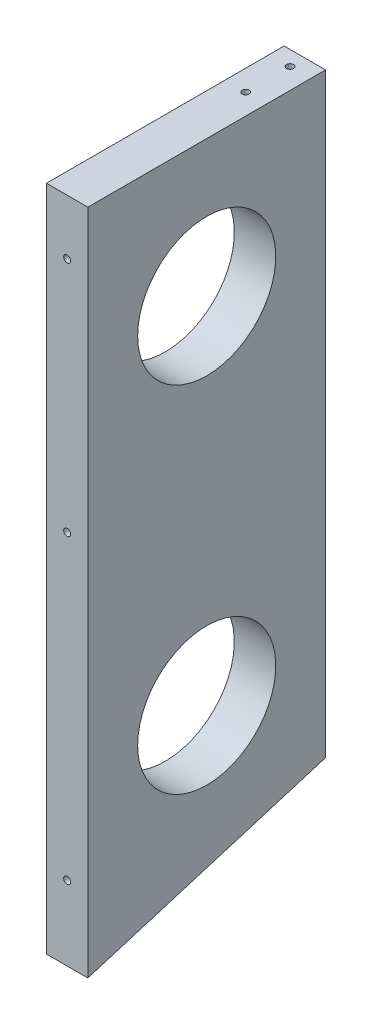
ISO-10303-21;
HEADER;
FILE_DESCRIPTION(('STEP AP214'),'2;1');
FILE_NAME('part.step','',(''),(''),'','','');
FILE_SCHEMA(('AUTOMOTIVE_DESIGN { 1 0 10303 214 1 1 1 1 }'));
ENDSEC;
DATA;
#1=APPLICATION_CONTEXT('core data for automotive mechanical design processes');
#2=APPLICATION_PROTOCOL_DEFINITION('international standard','automotive_design',2000,#1);
#3=PRODUCT_CONTEXT('',#1,'mechanical');
#4=PRODUCT('Part','Part','',(#3));
#5=PRODUCT_RELATED_PRODUCT_CATEGORY('part','',(#4));
#6=PRODUCT_DEFINITION_FORMATION('','',#4);
#7=PRODUCT_DEFINITION_CONTEXT('part definition',#1,'design');
#8=PRODUCT_DEFINITION('design','',#6,#7);
#9=PRODUCT_DEFINITION_SHAPE('','',#8);
#10=(LENGTH_UNIT() NAMED_UNIT(*) SI_UNIT(.MILLI.,.METRE.));
#11=(NAMED_UNIT(*) PLANE_ANGLE_UNIT() SI_UNIT($,.RADIAN.));
#12=(NAMED_UNIT(*) SI_UNIT($,.STERADIAN.) SOLID_ANGLE_UNIT());
#13=UNCERTAINTY_MEASURE_WITH_UNIT(LENGTH_MEASURE(1.E-05),#10,'distance_accuracy_value','');
#14=(GEOMETRIC_REPRESENTATION_CONTEXT(3) GLOBAL_UNCERTAINTY_ASSIGNED_CONTEXT((#13)) GLOBAL_UNIT_ASSIGNED_CONTEXT((#10,
#11,#12)) REPRESENTATION_CONTEXT('',''));
#15=CARTESIAN_POINT('',(0.,0.,0.));
#16=DIRECTION('',(0.,0.,1.));
#17=DIRECTION('',(1.,0.,0.));
#18=AXIS2_PLACEMENT_3D('',#15,#16,#17);
#19=CARTESIAN_POINT('',(-133.529465969192,-157.30000000001,304.663224626951));
#20=DIRECTION('',(1.,0.,0.));
#21=DIRECTION('',(0.,1.00000000000003,0.));
#22=AXIS2_PLACEMENT_3D('',#19,#20,#21);
#23=PLANE('',#22);
#24=CARTESIAN_POINT('',(-133.529465969192,-383.056061932783,54.6500000000077));
#25=DIRECTION('',(-0.999999999999999,0.,0.));
#26=DIRECTION('',(0.,0.,1.00000000000002));
#27=AXIS2_PLACEMENT_3D('',#24,#25,#26);
#28=CIRCLE('',#27,31.75);
#29=CARTESIAN_POINT('',(-133.529465969192,-383.056061932783,86.4000000000084));
#30=VERTEX_POINT('',#29);
#31=EDGE_CURVE('E120',#30,#30,#28,.T.);
#32=ORIENTED_EDGE('',*,*,#31,.F.);
#33=EDGE_LOOP('',(#32));
#34=FACE_BOUND('',#33,.T.);
#35=DIRECTION('',(0.,-1.00000000000003,0.));
#36=VECTOR('',#35,1.);
#37=CARTESIAN_POINT('',(-133.529465969193,-157.300000000006,2.60902410786912E-12));
#38=LINE('',#37,#36);
#39=CARTESIAN_POINT('',(-133.529465969193,-157.300000000006,2.60902410786912E-12));
#40=VERTEX_POINT('',#39);
#41=CARTESIAN_POINT('',(-133.529465969192,-431.185843453159,7.18869408444789E-12));
#42=VERTEX_POINT('',#41);
#43=EDGE_CURVE('E43',#40,#42,#38,.T.);
#44=ORIENTED_EDGE('',*,*,#43,.T.);
#45=DIRECTION('',(0.,-0.289678602973869,0.957123976807169));
#46=VECTOR('',#45,1.);
#47=CARTESIAN_POINT('',(-133.529465969192,-464.266063019556,109.300000000011));
#48=LINE('',#47,#46);
#49=CARTESIAN_POINT('',(-133.529465969192,-464.266063019556,109.300000000011));
#50=VERTEX_POINT('',#49);
#51=EDGE_CURVE('E163',#42,#50,#48,.T.);
#52=ORIENTED_EDGE('',*,*,#51,.T.);
#53=DIRECTION('',(0.,-1.00000000000003,0.));
#54=VECTOR('',#53,1.);
#55=CARTESIAN_POINT('',(-133.529465969192,-157.300000000008,109.300000000005));
#56=LINE('',#55,#54);
#57=CARTESIAN_POINT('',(-133.529465969192,-157.300000000008,109.300000000006));
#58=VERTEX_POINT('',#57);
#59=EDGE_CURVE('E169',#58,#50,#56,.T.);
#60=ORIENTED_EDGE('',*,*,#59,.F.);
#61=DIRECTION('',(0.,0.,-1.00000000000002));
#62=VECTOR('',#61,1.);
#63=CARTESIAN_POINT('',(-133.529465969192,-157.30000000001,304.663224626951));
#64=LINE('',#63,#62);
#65=EDGE_CURVE('E51',#58,#40,#64,.T.);
#66=ORIENTED_EDGE('',*,*,#65,.T.);
#67=EDGE_LOOP('',(#44,#52,#60,#66));
#68=FACE_BOUND('',#67,.T.);
#69=CARTESIAN_POINT('',(-133.529465969192,-220.048030423009,54.6500000000054));
#70=DIRECTION('',(-0.999999999999999,0.,0.));
#71=DIRECTION('',(0.,0.,1.00000000000002));
#72=AXIS2_PLACEMENT_3D('',#69,#70,#71);
#73=CIRCLE('',#72,31.75);
#74=CARTESIAN_POINT('',(-133.529465969192,-220.048030423009,86.4000000000061));
#75=VERTEX_POINT('',#74);
#76=EDGE_CURVE('E411',#75,#75,#73,.T.);
#77=ORIENTED_EDGE('',*,*,#76,.F.);
#78=EDGE_LOOP('',(#77));
#79=FACE_BOUND('',#78,.T.);
#80=ADVANCED_FACE('F34',(#34,#68,#79),#23,.F.);
#81=CARTESIAN_POINT('',(-133.529465969192,-157.30000000001,304.663224626951));
#82=DIRECTION('',(0.,-1.00000000000003,0.));
#83=DIRECTION('',(0.,0.,-1.00000000000002));
#84=AXIS2_PLACEMENT_3D('',#81,#82,#83);
#85=PLANE('',#84);
#86=CARTESIAN_POINT('',(-124.004465969192,-157.300000000007,27.2000000000031));
#87=DIRECTION('',(0.,-1.00000000000003,0.));
#88=DIRECTION('',(0.,0.,-1.00000000000002));
#89=AXIS2_PLACEMENT_3D('',#86,#87,#88);
#90=CIRCLE('',#89,1.5875);
#91=CARTESIAN_POINT('',(-124.004465969192,-157.300000000006,25.612500000003));
#92=VERTEX_POINT('',#91);
#93=EDGE_CURVE('E142',#92,#92,#90,.T.);
#94=ORIENTED_EDGE('',*,*,#93,.T.);
#95=EDGE_LOOP('',(#94));
#96=FACE_BOUND('',#95,.T.);
#97=CARTESIAN_POINT('',(-124.004465969192,-157.300000000006,6.80000000000236));
#98=DIRECTION('',(0.,-1.00000000000003,0.));
#99=DIRECTION('',(0.,0.,-1.00000000000002));
#100=AXIS2_PLACEMENT_3D('',#97,#98,#99);
#101=CIRCLE('',#100,1.5875);
#102=CARTESIAN_POINT('',(-124.004465969192,-157.300000000006,5.21250000000232));
#103=VERTEX_POINT('',#102);
#104=EDGE_CURVE('E146',#103,#103,#101,.T.);
#105=ORIENTED_EDGE('',*,*,#104,.T.);
#106=EDGE_LOOP('',(#105));
#107=FACE_BOUND('',#106,.T.);
#108=ORIENTED_EDGE('',*,*,#65,.F.);
#109=DIRECTION('',(-1.,0.,0.));
#110=VECTOR('',#109,1.);
#111=CARTESIAN_POINT('',(-114.479465969193,-157.300000000008,109.300000000006));
#112=LINE('',#111,#110);
#113=CARTESIAN_POINT('',(-114.479465969192,-157.300000000008,109.300000000005));
#114=VERTEX_POINT('',#113);
#115=EDGE_CURVE('E172',#114,#58,#112,.T.);
#116=ORIENTED_EDGE('',*,*,#115,.F.);
#117=DIRECTION('',(0.,0.,-1.00000000000002));
#118=VECTOR('',#117,1.);
#119=CARTESIAN_POINT('',(-114.479465969192,-157.300000000011,304.663224626951));
#120=LINE('',#119,#118);
#121=CARTESIAN_POINT('',(-114.479465969192,-157.300000000005,2.41473507855972E-12));
#122=VERTEX_POINT('',#121);
#123=EDGE_CURVE('E59',#114,#122,#120,.T.);
#124=ORIENTED_EDGE('',*,*,#123,.T.);
#125=DIRECTION('',(-0.999999999999999,0.,0.));
#126=VECTOR('',#125,1.);
#127=CARTESIAN_POINT('',(-133.529465969193,-157.300000000006,2.60902410786912E-12));
#128=LINE('',#127,#126);
#129=EDGE_CURVE('E180',#122,#40,#128,.T.);
#130=ORIENTED_EDGE('',*,*,#129,.T.);
#131=EDGE_LOOP('',(#108,#116,#124,#130));
#132=FACE_BOUND('',#131,.T.);
#133=ADVANCED_FACE('F36',(#96,#107,#132),#85,.F.);
#134=CARTESIAN_POINT('',(-114.479465969192,-157.300000000011,304.663224626951));
#135=DIRECTION('',(-1.,0.,0.));
#136=DIRECTION('',(0.,-1.00000000000003,0.));
#137=AXIS2_PLACEMENT_3D('',#134,#135,#136);
#138=PLANE('',#137);
#139=CARTESIAN_POINT('',(-114.479465969192,-220.048030423009,54.6500000000053));
#140=DIRECTION('',(-1.,0.,0.));
#141=DIRECTION('',(0.,-1.00000000000003,0.));
#142=AXIS2_PLACEMENT_3D('',#139,#140,#141);
#143=CIRCLE('',#142,31.75);
#144=CARTESIAN_POINT('',(-114.479465969192,-251.79803042301,54.6500000000058));
#145=VERTEX_POINT('',#144);
#146=EDGE_CURVE('E408',#145,#145,#143,.T.);
#147=ORIENTED_EDGE('',*,*,#146,.T.);
#148=EDGE_LOOP('',(#147));
#149=FACE_BOUND('',#148,.T.);
#150=CARTESIAN_POINT('',(-114.479465969192,-383.056061932783,54.6500000000078));
#151=DIRECTION('',(-1.,0.,0.));
#152=DIRECTION('',(0.,-1.00000000000003,0.));
#153=AXIS2_PLACEMENT_3D('',#150,#151,#152);
#154=CIRCLE('',#153,31.75);
#155=CARTESIAN_POINT('',(-114.479465969192,-414.806061932784,54.6500000000083));
#156=VERTEX_POINT('',#155);
#157=EDGE_CURVE('E115',#156,#156,#154,.T.);
#158=ORIENTED_EDGE('',*,*,#157,.T.);
#159=EDGE_LOOP('',(#158));
#160=FACE_BOUND('',#159,.T.);
#161=ORIENTED_EDGE('',*,*,#123,.F.);
#162=DIRECTION('',(0.,1.00000000000003,0.));
#163=VECTOR('',#162,1.);
#164=CARTESIAN_POINT('',(-114.479465969192,-427.342121692014,109.30000000001));
#165=LINE('',#164,#163);
#166=CARTESIAN_POINT('',(-114.479465969192,-464.266063019556,109.30000000001));
#167=VERTEX_POINT('',#166);
#168=EDGE_CURVE('E175',#167,#114,#165,.T.);
#169=ORIENTED_EDGE('',*,*,#168,.F.);
#170=DIRECTION('',(0.,-0.289678602973869,0.957123976807169));
#171=VECTOR('',#170,1.);
#172=CARTESIAN_POINT('',(-114.479465969192,-464.266063019556,109.30000000001));
#173=LINE('',#172,#171);
#174=CARTESIAN_POINT('',(-114.479465969192,-431.185843453159,7.105427357601E-12));
#175=VERTEX_POINT('',#174);
#176=EDGE_CURVE('E159',#175,#167,#173,.T.);
#177=ORIENTED_EDGE('',*,*,#176,.F.);
#178=DIRECTION('',(0.,1.00000000000003,0.));
#179=VECTOR('',#178,1.);
#180=CARTESIAN_POINT('',(-114.479465969192,-157.300000000005,2.41473507855972E-12));
#181=LINE('',#180,#179);
#182=EDGE_CURVE('E11',#175,#122,#181,.T.);
#183=ORIENTED_EDGE('',*,*,#182,.T.);
#184=EDGE_LOOP('',(#161,#169,#177,#183));
#185=FACE_BOUND('',#184,.T.);
#186=ADVANCED_FACE('F220',(#149,#160,#185),#138,.F.);
#187=CARTESIAN_POINT('',(0.,0.,0.));
#188=DIRECTION('',(0.,0.,-1.00000000000002));
#189=DIRECTION('',(-0.999999999999999,0.,0.));
#190=AXIS2_PLACEMENT_3D('',#187,#188,#189);
#191=PLANE('',#190);
#192=CARTESIAN_POINT('',(-124.004465969192,-182.700000000007,3.3584246494911E-12));
#193=DIRECTION('',(0.,0.,-1.00000000000002));
#194=DIRECTION('',(-0.999999999999999,0.,0.));
#195=AXIS2_PLACEMENT_3D('',#192,#193,#194);
#196=CIRCLE('',#195,1.58750000000001);
#197=CARTESIAN_POINT('',(-125.591965969192,-182.700000000007,3.35930588901689E-12));
#198=VERTEX_POINT('',#197);
#199=EDGE_CURVE('E130',#198,#198,#196,.T.);
#200=ORIENTED_EDGE('',*,*,#199,.F.);
#201=EDGE_LOOP('',(#200));
#202=FACE_BOUND('',#201,.T.);
#203=CARTESIAN_POINT('',(-124.004465969192,-291.546060846016,5.10702591327572E-12));
#204=DIRECTION('',(0.,0.,-1.00000000000002));
#205=DIRECTION('',(-0.999999999999999,0.,0.));
#206=AXIS2_PLACEMENT_3D('',#203,#204,#205);
#207=CIRCLE('',#206,1.58750000000001);
#208=CARTESIAN_POINT('',(-125.591965969192,-291.546060846016,5.10790715280152E-12));
#209=VERTEX_POINT('',#208);
#210=EDGE_CURVE('E134',#209,#209,#207,.T.);
#211=ORIENTED_EDGE('',*,*,#210,.F.);
#212=EDGE_LOOP('',(#211));
#213=FACE_BOUND('',#212,.T.);
#214=CARTESIAN_POINT('',(-124.004465969192,-401.942121691994,6.43929354282591E-12));
#215=DIRECTION('',(0.,0.,-1.00000000000002));
#216=DIRECTION('',(-0.999999999999999,0.,0.));
#217=AXIS2_PLACEMENT_3D('',#214,#215,#216);
#218=CIRCLE('',#217,1.5875);
#219=CARTESIAN_POINT('',(-125.591965969192,-401.942121691994,6.4401747823517E-12));
#220=VERTEX_POINT('',#219);
#221=EDGE_CURVE('E138',#220,#220,#218,.T.);
#222=ORIENTED_EDGE('',*,*,#221,.F.);
#223=EDGE_LOOP('',(#222));
#224=FACE_BOUND('',#223,.T.);
#225=ORIENTED_EDGE('',*,*,#129,.F.);
#226=ORIENTED_EDGE('',*,*,#182,.F.);
#227=DIRECTION('',(-1.,0.,0.));
#228=VECTOR('',#227,1.);
#229=CARTESIAN_POINT('',(-114.479465969192,-431.185843453159,7.105427357601E-12));
#230=LINE('',#229,#228);
#231=EDGE_CURVE('E162',#175,#42,#230,.T.);
#232=ORIENTED_EDGE('',*,*,#231,.T.);
#233=ORIENTED_EDGE('',*,*,#43,.F.);
#234=EDGE_LOOP('',(#225,#226,#232,#233));
#235=FACE_BOUND('',#234,.T.);
#236=ADVANCED_FACE('F218',(#202,#213,#224,#235),#191,.T.);
#237=CARTESIAN_POINT('',(4.57966997657877E-13,-204.862851166385,109.300000000006));
#238=DIRECTION('',(0.,0.,1.00000000000002));
#239=DIRECTION('',(-1.,0.,0.));
#240=AXIS2_PLACEMENT_3D('',#237,#238,#239);
#241=PLANE('',#240);
#242=CARTESIAN_POINT('',(-124.004465969192,-182.700000000009,109.300000000006));
#243=DIRECTION('',(0.,0.,1.00000000000002));
#244=DIRECTION('',(1.,0.,0.));
#245=AXIS2_PLACEMENT_3D('',#242,#243,#244);
#246=CIRCLE('',#245,1.58750000000001);
#247=CARTESIAN_POINT('',(-122.416965969192,-182.700000000009,109.300000000006));
#248=VERTEX_POINT('',#247);
#249=EDGE_CURVE('E150',#248,#248,#246,.T.);
#250=ORIENTED_EDGE('',*,*,#249,.F.);
#251=EDGE_LOOP('',(#250));
#252=FACE_BOUND('',#251,.T.);
#253=CARTESIAN_POINT('',(-124.004465969192,-430.129493562015,109.30000000001));
#254=DIRECTION('',(0.,0.,1.00000000000002));
#255=DIRECTION('',(1.,0.,0.));
#256=AXIS2_PLACEMENT_3D('',#253,#254,#255);
#257=CIRCLE('',#256,1.58750000000001);
#258=CARTESIAN_POINT('',(-122.416965969192,-430.129493562015,109.30000000001));
#259=VERTEX_POINT('',#258);
#260=EDGE_CURVE('E154',#259,#259,#257,.T.);
#261=ORIENTED_EDGE('',*,*,#260,.F.);
#262=EDGE_LOOP('',(#261));
#263=FACE_BOUND('',#262,.T.);
#264=CARTESIAN_POINT('',(-124.004465969192,-291.546060846017,109.300000000008));
#265=DIRECTION('',(0.,0.,1.00000000000002));
#266=DIRECTION('',(1.,0.,0.));
#267=AXIS2_PLACEMENT_3D('',#264,#265,#266);
#268=CIRCLE('',#267,1.58750000000001);
#269=CARTESIAN_POINT('',(-122.416965969192,-291.546060846017,109.300000000008));
#270=VERTEX_POINT('',#269);
#271=EDGE_CURVE('E158',#270,#270,#268,.T.);
#272=ORIENTED_EDGE('',*,*,#271,.F.);
#273=EDGE_LOOP('',(#272));
#274=FACE_BOUND('',#273,.T.);
#275=ORIENTED_EDGE('',*,*,#59,.T.);
#276=DIRECTION('',(-1.,0.,0.));
#277=VECTOR('',#276,1.);
#278=CARTESIAN_POINT('',(-114.479465969192,-464.266063019556,109.30000000001));
#279=LINE('',#278,#277);
#280=EDGE_CURVE('E166',#167,#50,#279,.T.);
#281=ORIENTED_EDGE('',*,*,#280,.F.);
#282=ORIENTED_EDGE('',*,*,#168,.T.);
#283=ORIENTED_EDGE('',*,*,#115,.T.);
#284=EDGE_LOOP('',(#275,#281,#282,#283));
#285=FACE_BOUND('',#284,.T.);
#286=ADVANCED_FACE('F208',(#252,#263,#274,#285),#241,.T.);
#287=CARTESIAN_POINT('',(-114.479465969192,-464.266063019556,109.30000000001));
#288=DIRECTION('',(0.,-0.957123976807169,-0.289678602973836));
#289=DIRECTION('',(0.,0.289678602973869,-0.957123976807169));
#290=AXIS2_PLACEMENT_3D('',#287,#288,#289);
#291=PLANE('',#290);
#292=CARTESIAN_POINT('',(-124.004465969193,-439.455898344757,27.3250000000025));
#293=DIRECTION('',(0.,-0.957123976807169,-0.289678602973836));
#294=DIRECTION('',(0.,0.289678602973869,-0.957123976807169));
#295=AXIS2_PLACEMENT_3D('',#292,#293,#294);
#296=CIRCLE('',#295,1.5875);
#297=CARTESIAN_POINT('',(-124.004465969193,-438.996033562536,25.8055656868212));
#298=VERTEX_POINT('',#297);
#299=EDGE_CURVE('E38',#298,#298,#296,.T.);
#300=ORIENTED_EDGE('',*,*,#299,.F.);
#301=EDGE_LOOP('',(#300));
#302=FACE_BOUND('',#301,.T.);
#303=CARTESIAN_POINT('',(-124.004465969193,-455.996008127955,81.9750000000042));
#304=DIRECTION('',(0.,-0.957123976807169,-0.289678602973836));
#305=DIRECTION('',(0.,0.289678602973869,-0.957123976807169));
#306=AXIS2_PLACEMENT_3D('',#303,#304,#305);
#307=CIRCLE('',#306,1.5875);
#308=CARTESIAN_POINT('',(-124.004465969193,-455.536143345734,80.4555656868228));
#309=VERTEX_POINT('',#308);
#310=EDGE_CURVE('E126',#309,#309,#307,.T.);
#311=ORIENTED_EDGE('',*,*,#310,.F.);
#312=EDGE_LOOP('',(#311));
#313=FACE_BOUND('',#312,.T.);
#314=ORIENTED_EDGE('',*,*,#51,.F.);
#315=ORIENTED_EDGE('',*,*,#231,.F.);
#316=ORIENTED_EDGE('',*,*,#176,.T.);
#317=ORIENTED_EDGE('',*,*,#280,.T.);
#318=EDGE_LOOP('',(#314,#315,#316,#317));
#319=FACE_BOUND('',#318,.T.);
#320=ADVANCED_FACE('F204',(#302,#313,#319),#291,.T.);
#321=CARTESIAN_POINT('',(-124.004465969192,-291.546060846017,90.250000000007));
#322=DIRECTION('',(0.,0.,1.00000000000002));
#323=DIRECTION('',(0.999999999999999,0.,0.));
#324=AXIS2_PLACEMENT_3D('',#321,#322,#323);
#325=CONICAL_SURFACE('',#324,1.58750000000001,1.02974425867666);
#326=CARTESIAN_POINT('',(-124.004465969192,-291.546060846017,89.296133767301));
#327=VERTEX_POINT('',#326);
#328=VERTEX_LOOP('',#327);
#329=FACE_BOUND('',#328,.T.);
#330=CARTESIAN_POINT('',(-124.004465969192,-291.546060846017,90.250000000007));
#331=DIRECTION('',(0.,0.,1.00000000000002));
#332=DIRECTION('',(0.999999999999999,0.,0.));
#333=AXIS2_PLACEMENT_3D('',#330,#331,#332);
#334=CIRCLE('',#333,1.58750000000001);
#335=CARTESIAN_POINT('',(-122.416965969192,-291.546060846017,90.250000000007));
#336=VERTEX_POINT('',#335);
#337=EDGE_CURVE('E155',#336,#336,#334,.T.);
#338=ORIENTED_EDGE('',*,*,#337,.T.);
#339=EDGE_LOOP('',(#338));
#340=FACE_BOUND('',#339,.T.);
#341=ADVANCED_FACE('F207',(#329,#340),#325,.F.);
#342=CARTESIAN_POINT('',(-124.004465969192,-291.546060846018,122.000000000007));
#343=DIRECTION('',(0.,0.,1.00000000000002));
#344=DIRECTION('',(0.999999999999999,0.,0.));
#345=AXIS2_PLACEMENT_3D('',#342,#343,#344);
#346=CYLINDRICAL_SURFACE('',#345,1.58750000000001);
#347=ORIENTED_EDGE('',*,*,#271,.T.);
#348=EDGE_LOOP('',(#347));
#349=FACE_BOUND('',#348,.T.);
#350=ORIENTED_EDGE('',*,*,#337,.F.);
#351=EDGE_LOOP('',(#350));
#352=FACE_BOUND('',#351,.T.);
#353=ADVANCED_FACE('F266',(#349,#352),#346,.F.);
#354=CARTESIAN_POINT('',(-124.004465969192,-430.129493562014,90.2500000000092));
#355=DIRECTION('',(0.,0.,1.00000000000002));
#356=DIRECTION('',(0.999999999999999,0.,0.));
#357=AXIS2_PLACEMENT_3D('',#354,#355,#356);
#358=CONICAL_SURFACE('',#357,1.58750000000001,1.02974425867666);
#359=CARTESIAN_POINT('',(-124.004465969192,-430.129493562014,89.2961337673028));
#360=VERTEX_POINT('',#359);
#361=VERTEX_LOOP('',#360);
#362=FACE_BOUND('',#361,.T.);
#363=CARTESIAN_POINT('',(-124.004465969192,-430.129493562014,90.2500000000092));
#364=DIRECTION('',(0.,0.,1.00000000000002));
#365=DIRECTION('',(0.999999999999999,0.,0.));
#366=AXIS2_PLACEMENT_3D('',#363,#364,#365);
#367=CIRCLE('',#366,1.58750000000001);
#368=CARTESIAN_POINT('',(-122.416965969192,-430.129493562014,90.2500000000092));
#369=VERTEX_POINT('',#368);
#370=EDGE_CURVE('E151',#369,#369,#367,.T.);
#371=ORIENTED_EDGE('',*,*,#370,.T.);
#372=EDGE_LOOP('',(#371));
#373=FACE_BOUND('',#372,.T.);
#374=ADVANCED_FACE('F262',(#362,#373),#358,.F.);
#375=CARTESIAN_POINT('',(-124.004465969192,-430.129493562014,122.00000000001));
#376=DIRECTION('',(0.,0.,1.00000000000002));
#377=DIRECTION('',(0.999999999999999,0.,0.));
#378=AXIS2_PLACEMENT_3D('',#375,#376,#377);
#379=CYLINDRICAL_SURFACE('',#378,1.58750000000001);
#380=ORIENTED_EDGE('',*,*,#260,.T.);
#381=EDGE_LOOP('',(#380));
#382=FACE_BOUND('',#381,.T.);
#383=ORIENTED_EDGE('',*,*,#370,.F.);
#384=EDGE_LOOP('',(#383));
#385=FACE_BOUND('',#384,.T.);
#386=ADVANCED_FACE('F258',(#382,#385),#379,.F.);
#387=CARTESIAN_POINT('',(-124.004465969192,-182.700000000008,90.2500000000051));
#388=DIRECTION('',(0.,0.,1.00000000000002));
#389=DIRECTION('',(0.999999999999999,0.,0.));
#390=AXIS2_PLACEMENT_3D('',#387,#388,#389);
#391=CONICAL_SURFACE('',#390,1.58750000000001,1.02974425867666);
#392=CARTESIAN_POINT('',(-124.004465969192,-182.700000000008,89.2961337672989));
#393=VERTEX_POINT('',#392);
#394=VERTEX_LOOP('',#393);
#395=FACE_BOUND('',#394,.T.);
#396=CARTESIAN_POINT('',(-124.004465969192,-182.700000000008,90.2500000000051));
#397=DIRECTION('',(0.,0.,1.00000000000002));
#398=DIRECTION('',(0.999999999999999,0.,0.));
#399=AXIS2_PLACEMENT_3D('',#396,#397,#398);
#400=CIRCLE('',#399,1.58750000000001);
#401=CARTESIAN_POINT('',(-122.416965969192,-182.700000000008,90.2500000000051));
#402=VERTEX_POINT('',#401);
#403=EDGE_CURVE('E147',#402,#402,#400,.T.);
#404=ORIENTED_EDGE('',*,*,#403,.T.);
#405=EDGE_LOOP('',(#404));
#406=FACE_BOUND('',#405,.T.);
#407=ADVANCED_FACE('F248',(#395,#406),#391,.F.);
#408=CARTESIAN_POINT('',(-124.004465969192,-182.700000000009,122.000000000006));
#409=DIRECTION('',(0.,0.,1.00000000000002));
#410=DIRECTION('',(0.999999999999999,0.,0.));
#411=AXIS2_PLACEMENT_3D('',#408,#409,#410);
#412=CYLINDRICAL_SURFACE('',#411,1.58750000000001);
#413=ORIENTED_EDGE('',*,*,#249,.T.);
#414=EDGE_LOOP('',(#413));
#415=FACE_BOUND('',#414,.T.);
#416=ORIENTED_EDGE('',*,*,#403,.F.);
#417=EDGE_LOOP('',(#416));
#418=FACE_BOUND('',#417,.T.);
#419=ADVANCED_FACE('F238',(#415,#418),#412,.F.);
#420=CARTESIAN_POINT('',(-124.004465969192,-144.600000000006,6.80000000000267));
#421=DIRECTION('',(0.,1.00000000000003,0.));
#422=DIRECTION('',(0.,0.,1.00000000000002));
#423=AXIS2_PLACEMENT_3D('',#420,#421,#422);
#424=CYLINDRICAL_SURFACE('',#423,1.5875);
#425=CARTESIAN_POINT('',(-124.004465969192,-176.350000000006,6.80000000000347));
#426=DIRECTION('',(0.,1.00000000000003,0.));
#427=DIRECTION('',(0.,0.,1.00000000000002));
#428=AXIS2_PLACEMENT_3D('',#425,#426,#427);
#429=CIRCLE('',#428,1.58749999999999);
#430=CARTESIAN_POINT('',(-124.004465969192,-176.350000000006,8.3875000000035));
#431=VERTEX_POINT('',#430);
#432=EDGE_CURVE('E143',#431,#431,#429,.T.);
#433=ORIENTED_EDGE('',*,*,#432,.F.);
#434=EDGE_LOOP('',(#433));
#435=FACE_BOUND('',#434,.T.);
#436=ORIENTED_EDGE('',*,*,#104,.F.);
#437=EDGE_LOOP('',(#436));
#438=FACE_BOUND('',#437,.T.);
#439=ADVANCED_FACE('F235',(#435,#438),#424,.F.);
#440=CARTESIAN_POINT('',(-124.004465969192,-176.350000000006,6.80000000000347));
#441=DIRECTION('',(0.,1.00000000000003,0.));
#442=DIRECTION('',(0.,0.,1.00000000000002));
#443=AXIS2_PLACEMENT_3D('',#440,#441,#442);
#444=CONICAL_SURFACE('',#443,1.58749999999999,1.02974425867666);
#445=CARTESIAN_POINT('',(-124.004465969192,-177.303866232713,6.80000000000319));
#446=VERTEX_POINT('',#445);
#447=VERTEX_LOOP('',#446);
#448=FACE_BOUND('',#447,.T.);
#449=ORIENTED_EDGE('',*,*,#432,.T.);
#450=EDGE_LOOP('',(#449));
#451=FACE_BOUND('',#450,.T.);
#452=ADVANCED_FACE('F237',(#448,#451),#444,.F.);
#453=CARTESIAN_POINT('',(-124.004465969192,-144.600000000006,27.2000000000033));
#454=DIRECTION('',(0.,1.00000000000003,0.));
#455=DIRECTION('',(0.,0.,1.00000000000002));
#456=AXIS2_PLACEMENT_3D('',#453,#454,#455);
#457=CYLINDRICAL_SURFACE('',#456,1.5875);
#458=CARTESIAN_POINT('',(-124.004465969192,-176.350000000007,27.2000000000041));
#459=DIRECTION('',(0.,1.00000000000003,0.));
#460=DIRECTION('',(0.,0.,1.00000000000002));
#461=AXIS2_PLACEMENT_3D('',#458,#459,#460);
#462=CIRCLE('',#461,1.58749999999999);
#463=CARTESIAN_POINT('',(-124.004465969192,-176.350000000007,28.7875000000041));
#464=VERTEX_POINT('',#463);
#465=EDGE_CURVE('E139',#464,#464,#462,.T.);
#466=ORIENTED_EDGE('',*,*,#465,.F.);
#467=EDGE_LOOP('',(#466));
#468=FACE_BOUND('',#467,.T.);
#469=ORIENTED_EDGE('',*,*,#93,.F.);
#470=EDGE_LOOP('',(#469));
#471=FACE_BOUND('',#470,.T.);
#472=ADVANCED_FACE('F245',(#468,#471),#457,.F.);
#473=CARTESIAN_POINT('',(-124.004465969192,-176.350000000007,27.2000000000041));
#474=DIRECTION('',(0.,1.00000000000003,0.));
#475=DIRECTION('',(0.,0.,1.00000000000002));
#476=AXIS2_PLACEMENT_3D('',#473,#474,#475);
#477=CONICAL_SURFACE('',#476,1.58749999999999,1.02974425867666);
#478=CARTESIAN_POINT('',(-124.004465969192,-177.303866232713,27.2000000000039));
#479=VERTEX_POINT('',#478);
#480=VERTEX_LOOP('',#479);
#481=FACE_BOUND('',#480,.T.);
#482=ORIENTED_EDGE('',*,*,#465,.T.);
#483=EDGE_LOOP('',(#482));
#484=FACE_BOUND('',#483,.T.);
#485=ADVANCED_FACE('F253',(#481,#484),#477,.F.);
#486=CARTESIAN_POINT('',(-124.004465969192,-401.942121691995,19.0500000000071));
#487=DIRECTION('',(0.,0.,-1.00000000000002));
#488=DIRECTION('',(0.,1.00000000000003,0.));
#489=AXIS2_PLACEMENT_3D('',#486,#487,#488);
#490=CONICAL_SURFACE('',#489,1.58749999999999,1.02974425867665);
#491=CARTESIAN_POINT('',(-124.004465969192,-401.942121691995,20.0038662327134));
#492=VERTEX_POINT('',#491);
#493=VERTEX_LOOP('',#492);
#494=FACE_BOUND('',#493,.T.);
#495=CARTESIAN_POINT('',(-124.004465969192,-401.942121691995,19.0500000000071));
#496=DIRECTION('',(0.,0.,-1.00000000000002));
#497=DIRECTION('',(0.,1.00000000000003,0.));
#498=AXIS2_PLACEMENT_3D('',#495,#496,#497);
#499=CIRCLE('',#498,1.58749999999999);
#500=CARTESIAN_POINT('',(-124.004465969192,-400.354621691995,19.0500000000071));
#501=VERTEX_POINT('',#500);
#502=EDGE_CURVE('E135',#501,#501,#499,.T.);
#503=ORIENTED_EDGE('',*,*,#502,.T.);
#504=EDGE_LOOP('',(#503));
#505=FACE_BOUND('',#504,.T.);
#506=ADVANCED_FACE('F291',(#494,#505),#490,.F.);
#507=CARTESIAN_POINT('',(-124.004465969192,-401.942121691994,-12.6999999999935));
#508=DIRECTION('',(0.,0.,-1.00000000000002));
#509=DIRECTION('',(0.,1.00000000000003,0.));
#510=AXIS2_PLACEMENT_3D('',#507,#508,#509);
#511=CYLINDRICAL_SURFACE('',#510,1.5875);
#512=ORIENTED_EDGE('',*,*,#221,.T.);
#513=EDGE_LOOP('',(#512));
#514=FACE_BOUND('',#513,.T.);
#515=ORIENTED_EDGE('',*,*,#502,.F.);
#516=EDGE_LOOP('',(#515));
#517=FACE_BOUND('',#516,.T.);
#518=ADVANCED_FACE('F287',(#514,#517),#511,.F.);
#519=CARTESIAN_POINT('',(-124.004465969192,-291.546060846016,19.0500000000054));
#520=DIRECTION('',(0.,0.,-1.00000000000002));
#521=DIRECTION('',(0.,1.00000000000003,0.));
#522=AXIS2_PLACEMENT_3D('',#519,#520,#521);
#523=CONICAL_SURFACE('',#522,1.58750000000001,1.02974425867666);
#524=CARTESIAN_POINT('',(-124.004465969192,-291.546060846016,20.0038662327116));
#525=VERTEX_POINT('',#524);
#526=VERTEX_LOOP('',#525);
#527=FACE_BOUND('',#526,.T.);
#528=CARTESIAN_POINT('',(-124.004465969192,-291.546060846016,19.0500000000054));
#529=DIRECTION('',(0.,0.,-1.00000000000002));
#530=DIRECTION('',(0.,1.00000000000003,0.));
#531=AXIS2_PLACEMENT_3D('',#528,#529,#530);
#532=CIRCLE('',#531,1.58750000000001);
#533=CARTESIAN_POINT('',(-124.004465969192,-289.958560846015,19.0500000000053));
#534=VERTEX_POINT('',#533);
#535=EDGE_CURVE('E131',#534,#534,#532,.T.);
#536=ORIENTED_EDGE('',*,*,#535,.T.);
#537=EDGE_LOOP('',(#536));
#538=FACE_BOUND('',#537,.T.);
#539=ADVANCED_FACE('F290',(#527,#538),#523,.F.);
#540=CARTESIAN_POINT('',(-124.004465969192,-291.546060846015,-12.6999999999955));
#541=DIRECTION('',(0.,0.,-1.00000000000002));
#542=DIRECTION('',(0.,1.00000000000003,0.));
#543=AXIS2_PLACEMENT_3D('',#540,#541,#542);
#544=CYLINDRICAL_SURFACE('',#543,1.58750000000001);
#545=ORIENTED_EDGE('',*,*,#210,.T.);
#546=EDGE_LOOP('',(#545));
#547=FACE_BOUND('',#546,.T.);
#548=ORIENTED_EDGE('',*,*,#535,.F.);
#549=EDGE_LOOP('',(#548));
#550=FACE_BOUND('',#549,.T.);
#551=ADVANCED_FACE('F329',(#547,#550),#544,.F.);
#552=CARTESIAN_POINT('',(-124.004465969192,-182.700000000007,19.0500000000036));
#553=DIRECTION('',(0.,0.,-1.00000000000002));
#554=DIRECTION('',(0.,1.00000000000003,0.));
#555=AXIS2_PLACEMENT_3D('',#552,#553,#554);
#556=CONICAL_SURFACE('',#555,1.58750000000001,1.02974425867666);
#557=CARTESIAN_POINT('',(-124.004465969192,-182.700000000007,20.0038662327099));
#558=VERTEX_POINT('',#557);
#559=VERTEX_LOOP('',#558);
#560=FACE_BOUND('',#559,.T.);
#561=CARTESIAN_POINT('',(-124.004465969192,-182.700000000007,19.0500000000036));
#562=DIRECTION('',(0.,0.,-1.00000000000002));
#563=DIRECTION('',(0.,1.00000000000003,0.));
#564=AXIS2_PLACEMENT_3D('',#561,#562,#563);
#565=CIRCLE('',#564,1.58750000000001);
#566=CARTESIAN_POINT('',(-124.004465969192,-181.112500000007,19.0500000000036));
#567=VERTEX_POINT('',#566);
#568=EDGE_CURVE('E127',#567,#567,#565,.T.);
#569=ORIENTED_EDGE('',*,*,#568,.T.);
#570=EDGE_LOOP('',(#569));
#571=FACE_BOUND('',#570,.T.);
#572=ADVANCED_FACE('F336',(#560,#571),#556,.F.);
#573=CARTESIAN_POINT('',(-124.004465969192,-182.700000000007,-12.6999999999973));
#574=DIRECTION('',(0.,0.,-1.00000000000002));
#575=DIRECTION('',(0.,1.00000000000003,0.));
#576=AXIS2_PLACEMENT_3D('',#573,#574,#575);
#577=CYLINDRICAL_SURFACE('',#576,1.58750000000001);
#578=ORIENTED_EDGE('',*,*,#199,.T.);
#579=EDGE_LOOP('',(#578));
#580=FACE_BOUND('',#579,.T.);
#581=ORIENTED_EDGE('',*,*,#568,.F.);
#582=EDGE_LOOP('',(#581));
#583=FACE_BOUND('',#582,.T.);
#584=ADVANCED_FACE('F344',(#580,#583),#577,.F.);
#585=CARTESIAN_POINT('',(-124.004465969193,-437.76279636978,87.4933773866556));
#586=DIRECTION('',(0.,-0.957123976807168,-0.289678602973836));
#587=DIRECTION('',(0.,0.28967860297387,-0.957123976807169));
#588=AXIS2_PLACEMENT_3D('',#585,#586,#587);
#589=CONICAL_SURFACE('',#588,1.58749999999999,1.02974425867664);
#590=CARTESIAN_POINT('',(-124.004465969193,-436.84982812779,87.76969202437));
#591=VERTEX_POINT('',#590);
#592=VERTEX_LOOP('',#591);
#593=FACE_BOUND('',#592,.T.);
#594=CARTESIAN_POINT('',(-124.004465969193,-437.76279636978,87.4933773866556));
#595=DIRECTION('',(0.,-0.957123976807168,-0.289678602973836));
#596=DIRECTION('',(0.,0.28967860297387,-0.957123976807169));
#597=AXIS2_PLACEMENT_3D('',#594,#595,#596);
#598=CIRCLE('',#597,1.58749999999999);
#599=CARTESIAN_POINT('',(-124.004465969193,-437.302931587559,85.9739430734742));
#600=VERTEX_POINT('',#599);
#601=EDGE_CURVE('E118',#600,#600,#598,.T.);
#602=ORIENTED_EDGE('',*,*,#601,.T.);
#603=EDGE_LOOP('',(#602));
#604=FACE_BOUND('',#603,.T.);
#605=ADVANCED_FACE('F352',(#593,#604),#589,.F.);
#606=CARTESIAN_POINT('',(-124.004465969193,-468.151482633408,78.2960817422363));
#607=DIRECTION('',(0.,-0.957123976807168,-0.289678602973836));
#608=DIRECTION('',(0.,0.28967860297387,-0.957123976807169));
#609=AXIS2_PLACEMENT_3D('',#606,#607,#608);
#610=CYLINDRICAL_SURFACE('',#609,1.5875);
#611=ORIENTED_EDGE('',*,*,#310,.T.);
#612=EDGE_LOOP('',(#611));
#613=FACE_BOUND('',#612,.T.);
#614=ORIENTED_EDGE('',*,*,#601,.F.);
#615=EDGE_LOOP('',(#614));
#616=FACE_BOUND('',#615,.T.);
#617=ADVANCED_FACE('F109',(#613,#616),#610,.F.);
#618=CARTESIAN_POINT('',(-124.004465969193,-421.222686586581,32.8433773866537));
#619=DIRECTION('',(0.,-0.957123976807168,-0.289678602973836));
#620=DIRECTION('',(0.,0.28967860297387,-0.957123976807169));
#621=AXIS2_PLACEMENT_3D('',#618,#619,#620);
#622=CONICAL_SURFACE('',#621,1.58749999999999,1.02974425867664);
#623=CARTESIAN_POINT('',(-124.004465969193,-420.309718344591,33.1196920243684));
#624=VERTEX_POINT('',#623);
#625=VERTEX_LOOP('',#624);
#626=FACE_BOUND('',#625,.T.);
#627=CARTESIAN_POINT('',(-124.004465969193,-421.222686586581,32.8433773866537));
#628=DIRECTION('',(0.,-0.957123976807168,-0.289678602973836));
#629=DIRECTION('',(0.,0.28967860297387,-0.957123976807169));
#630=AXIS2_PLACEMENT_3D('',#627,#628,#629);
#631=CIRCLE('',#630,1.58749999999999);
#632=CARTESIAN_POINT('',(-124.004465969193,-420.76282180436,31.3239430734723));
#633=VERTEX_POINT('',#632);
#634=EDGE_CURVE('E113',#633,#633,#631,.T.);
#635=ORIENTED_EDGE('',*,*,#634,.T.);
#636=EDGE_LOOP('',(#635));
#637=FACE_BOUND('',#636,.T.);
#638=ADVANCED_FACE('F105',(#626,#637),#622,.F.);
#639=CARTESIAN_POINT('',(-124.004465969193,-451.611372850208,23.6460817422344));
#640=DIRECTION('',(0.,-0.957123976807168,-0.289678602973836));
#641=DIRECTION('',(0.,0.28967860297387,-0.957123976807169));
#642=AXIS2_PLACEMENT_3D('',#639,#640,#641);
#643=CYLINDRICAL_SURFACE('',#642,1.5875);
#644=ORIENTED_EDGE('',*,*,#299,.T.);
#645=EDGE_LOOP('',(#644));
#646=FACE_BOUND('',#645,.T.);
#647=ORIENTED_EDGE('',*,*,#634,.F.);
#648=EDGE_LOOP('',(#647));
#649=FACE_BOUND('',#648,.T.);
#650=ADVANCED_FACE('F108',(#646,#649),#643,.F.);
#651=CARTESIAN_POINT('',(-133.529465969192,-383.056061932783,54.6500000000077));
#652=DIRECTION('',(-0.999999999999999,0.,0.));
#653=DIRECTION('',(0.,0.,1.00000000000002));
#654=AXIS2_PLACEMENT_3D('',#651,#652,#653);
#655=CYLINDRICAL_SURFACE('',#654,31.75);
#656=ORIENTED_EDGE('',*,*,#157,.F.);
#657=EDGE_LOOP('',(#656));
#658=FACE_BOUND('',#657,.T.);
#659=ORIENTED_EDGE('',*,*,#31,.T.);
#660=EDGE_LOOP('',(#659));
#661=FACE_BOUND('',#660,.T.);
#662=ADVANCED_FACE('F377',(#658,#661),#655,.F.);
#663=CARTESIAN_POINT('',(-133.529465969192,-220.048030423009,54.6500000000054));
#664=DIRECTION('',(-0.999999999999999,0.,0.));
#665=DIRECTION('',(0.,0.,1.00000000000002));
#666=AXIS2_PLACEMENT_3D('',#663,#664,#665);
#667=CYLINDRICAL_SURFACE('',#666,31.75);
#668=ORIENTED_EDGE('',*,*,#146,.F.);
#669=EDGE_LOOP('',(#668));
#670=FACE_BOUND('',#669,.T.);
#671=ORIENTED_EDGE('',*,*,#76,.T.);
#672=EDGE_LOOP('',(#671));
#673=FACE_BOUND('',#672,.T.);
#674=ADVANCED_FACE('F395',(#670,#673),#667,.F.);
#675=CLOSED_SHELL('',(#80,#133,#186,#236,#286,#320,#341,#353,#374,#386,#407,#419,#439,#452,#472,
#485,#506,#518,#539,#551,#572,#584,#605,#617,#638,#650,#662,#674));
#676=MANIFOLD_SOLID_BREP('B2',#675);
#677=ADVANCED_BREP_SHAPE_REPRESENTATION('',(#18,#676),#14);
#678=SHAPE_DEFINITION_REPRESENTATION(#9,#677);
ENDSEC;
END-ISO-10303-21;
